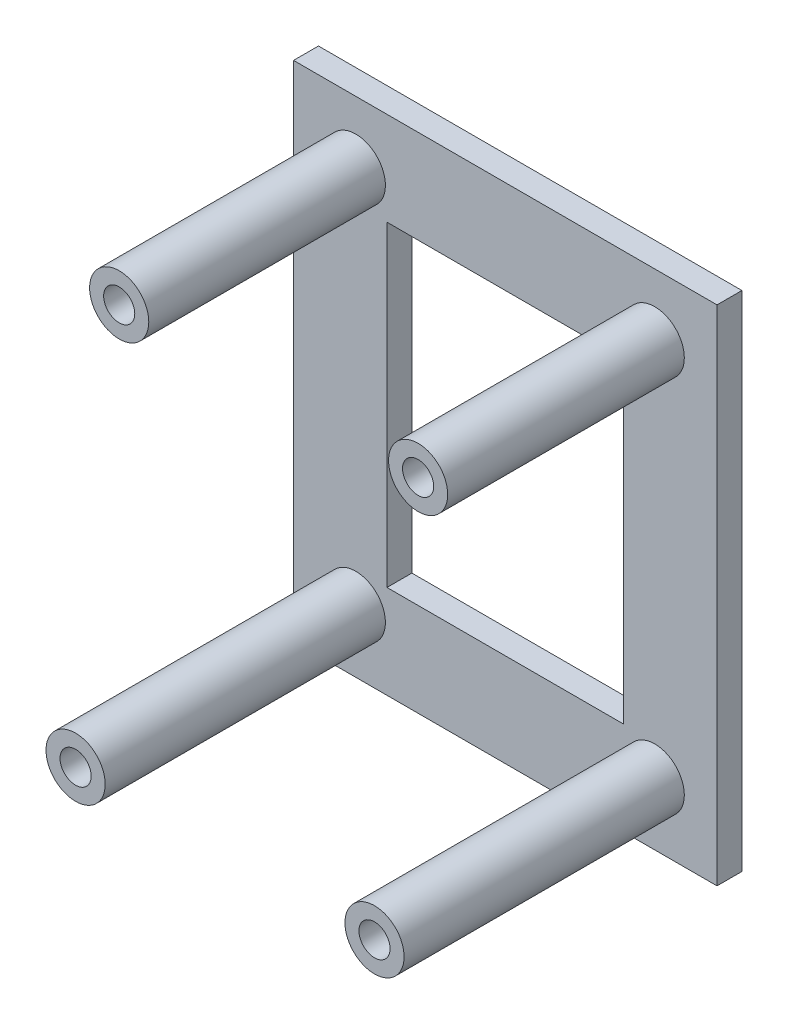
ISO-10303-21;
HEADER;
FILE_DESCRIPTION(('STEP AP214'),'2;1');
FILE_NAME('part.step','',(''),(''),'','','');
FILE_SCHEMA(('AUTOMOTIVE_DESIGN { 1 0 10303 214 1 1 1 1 }'));
ENDSEC;
DATA;
#1=APPLICATION_CONTEXT('core data for automotive mechanical design processes');
#2=APPLICATION_PROTOCOL_DEFINITION('international standard','automotive_design',2000,#1);
#3=PRODUCT_CONTEXT('',#1,'mechanical');
#4=PRODUCT('Part','Part','',(#3));
#5=PRODUCT_RELATED_PRODUCT_CATEGORY('part','',(#4));
#6=PRODUCT_DEFINITION_FORMATION('','',#4);
#7=PRODUCT_DEFINITION_CONTEXT('part definition',#1,'design');
#8=PRODUCT_DEFINITION('design','',#6,#7);
#9=PRODUCT_DEFINITION_SHAPE('','',#8);
#10=(LENGTH_UNIT() NAMED_UNIT(*) SI_UNIT(.MILLI.,.METRE.));
#11=(NAMED_UNIT(*) PLANE_ANGLE_UNIT() SI_UNIT($,.RADIAN.));
#12=(NAMED_UNIT(*) SI_UNIT($,.STERADIAN.) SOLID_ANGLE_UNIT());
#13=UNCERTAINTY_MEASURE_WITH_UNIT(LENGTH_MEASURE(1.E-05),#10,'distance_accuracy_value','');
#14=(GEOMETRIC_REPRESENTATION_CONTEXT(3) GLOBAL_UNCERTAINTY_ASSIGNED_CONTEXT((#13)) GLOBAL_UNIT_ASSIGNED_CONTEXT((#10,
#11,#12)) REPRESENTATION_CONTEXT('',''));
#15=CARTESIAN_POINT('',(0.,0.,0.));
#16=DIRECTION('',(0.,0.,1.));
#17=DIRECTION('',(1.,0.,0.));
#18=AXIS2_PLACEMENT_3D('',#15,#16,#17);
#19=CARTESIAN_POINT('',(-5.,20.2,2.));
#20=DIRECTION('',(1.,0.,0.));
#21=DIRECTION('',(0.,1.,0.));
#22=AXIS2_PLACEMENT_3D('',#19,#20,#21);
#23=PLANE('',#22);
#24=DIRECTION('',(0.,-1.,0.));
#25=VECTOR('',#24,1.);
#26=CARTESIAN_POINT('',(-5.,20.2,0.));
#27=LINE('',#26,#25);
#28=CARTESIAN_POINT('',(-5.,20.2,0.));
#29=VERTEX_POINT('',#28);
#30=CARTESIAN_POINT('',(-5.,-20.2,0.));
#31=VERTEX_POINT('',#30);
#32=EDGE_CURVE('E138',#29,#31,#27,.T.);
#33=ORIENTED_EDGE('',*,*,#32,.T.);
#34=DIRECTION('',(0.,0.,-1.));
#35=VECTOR('',#34,1.);
#36=CARTESIAN_POINT('',(-5.,-20.2,2.));
#37=LINE('',#36,#35);
#38=CARTESIAN_POINT('',(-5.,-20.2,2.));
#39=VERTEX_POINT('',#38);
#40=EDGE_CURVE('E12',#39,#31,#37,.T.);
#41=ORIENTED_EDGE('',*,*,#40,.F.);
#42=DIRECTION('',(0.,-1.,0.));
#43=VECTOR('',#42,1.);
#44=CARTESIAN_POINT('',(-5.,20.2,2.));
#45=LINE('',#44,#43);
#46=CARTESIAN_POINT('',(-5.,20.2,2.));
#47=VERTEX_POINT('',#46);
#48=EDGE_CURVE('E180',#47,#39,#45,.T.);
#49=ORIENTED_EDGE('',*,*,#48,.F.);
#50=DIRECTION('',(0.,0.,-1.));
#51=VECTOR('',#50,1.);
#52=CARTESIAN_POINT('',(-5.,20.2,2.));
#53=LINE('',#52,#51);
#54=EDGE_CURVE('E196',#47,#29,#53,.T.);
#55=ORIENTED_EDGE('',*,*,#54,.T.);
#56=EDGE_LOOP('',(#33,#41,#49,#55));
#57=FACE_BOUND('',#56,.T.);
#58=ADVANCED_FACE('F63',(#57),#23,.F.);
#59=CARTESIAN_POINT('',(-5.,-20.2,2.));
#60=DIRECTION('',(0.,1.,0.));
#61=DIRECTION('',(0.,0.,1.));
#62=AXIS2_PLACEMENT_3D('',#59,#60,#61);
#63=PLANE('',#62);
#64=DIRECTION('',(1.,0.,0.));
#65=VECTOR('',#64,1.);
#66=CARTESIAN_POINT('',(-5.,-20.2,0.));
#67=LINE('',#66,#65);
#68=CARTESIAN_POINT('',(29.,-20.2,0.));
#69=VERTEX_POINT('',#68);
#70=EDGE_CURVE('E200',#31,#69,#67,.T.);
#71=ORIENTED_EDGE('',*,*,#70,.T.);
#72=DIRECTION('',(0.,0.,-1.));
#73=VECTOR('',#72,1.);
#74=CARTESIAN_POINT('',(29.,-20.2,2.));
#75=LINE('',#74,#73);
#76=CARTESIAN_POINT('',(29.,-20.2,2.));
#77=VERTEX_POINT('',#76);
#78=EDGE_CURVE('E71',#77,#69,#75,.T.);
#79=ORIENTED_EDGE('',*,*,#78,.F.);
#80=DIRECTION('',(1.,0.,0.));
#81=VECTOR('',#80,1.);
#82=CARTESIAN_POINT('',(-5.,-20.2,2.));
#83=LINE('',#82,#81);
#84=EDGE_CURVE('E184',#39,#77,#83,.T.);
#85=ORIENTED_EDGE('',*,*,#84,.F.);
#86=ORIENTED_EDGE('',*,*,#40,.T.);
#87=EDGE_LOOP('',(#71,#79,#85,#86));
#88=FACE_BOUND('',#87,.T.);
#89=ADVANCED_FACE('F222',(#88),#63,.F.);
#90=CARTESIAN_POINT('',(29.,20.2,2.));
#91=DIRECTION('',(1.,0.,0.));
#92=DIRECTION('',(0.,1.,0.));
#93=AXIS2_PLACEMENT_3D('',#90,#91,#92);
#94=PLANE('',#93);
#95=DIRECTION('',(0.,-1.,0.));
#96=VECTOR('',#95,1.);
#97=CARTESIAN_POINT('',(29.,20.2,0.));
#98=LINE('',#97,#96);
#99=CARTESIAN_POINT('',(29.,20.2,0.));
#100=VERTEX_POINT('',#99);
#101=EDGE_CURVE('E204',#100,#69,#98,.T.);
#102=ORIENTED_EDGE('',*,*,#101,.F.);
#103=DIRECTION('',(0.,0.,-1.));
#104=VECTOR('',#103,1.);
#105=CARTESIAN_POINT('',(29.,20.2,2.));
#106=LINE('',#105,#104);
#107=CARTESIAN_POINT('',(29.,20.2,2.));
#108=VERTEX_POINT('',#107);
#109=EDGE_CURVE('E213',#108,#100,#106,.T.);
#110=ORIENTED_EDGE('',*,*,#109,.F.);
#111=DIRECTION('',(0.,-1.,0.));
#112=VECTOR('',#111,1.);
#113=CARTESIAN_POINT('',(29.,20.2,2.));
#114=LINE('',#113,#112);
#115=EDGE_CURVE('E188',#108,#77,#114,.T.);
#116=ORIENTED_EDGE('',*,*,#115,.T.);
#117=ORIENTED_EDGE('',*,*,#78,.T.);
#118=EDGE_LOOP('',(#102,#110,#116,#117));
#119=FACE_BOUND('',#118,.T.);
#120=ADVANCED_FACE('F219',(#119),#94,.T.);
#121=CARTESIAN_POINT('',(-5.,20.2,2.));
#122=DIRECTION('',(0.,1.,0.));
#123=DIRECTION('',(0.,0.,1.));
#124=AXIS2_PLACEMENT_3D('',#121,#122,#123);
#125=PLANE('',#124);
#126=DIRECTION('',(1.,0.,0.));
#127=VECTOR('',#126,1.);
#128=CARTESIAN_POINT('',(-5.,20.2,0.));
#129=LINE('',#128,#127);
#130=EDGE_CURVE('E185',#29,#100,#129,.T.);
#131=ORIENTED_EDGE('',*,*,#130,.F.);
#132=ORIENTED_EDGE('',*,*,#54,.F.);
#133=DIRECTION('',(1.,0.,0.));
#134=VECTOR('',#133,1.);
#135=CARTESIAN_POINT('',(-5.,20.2,2.));
#136=LINE('',#135,#134);
#137=EDGE_CURVE('E192',#47,#108,#136,.T.);
#138=ORIENTED_EDGE('',*,*,#137,.T.);
#139=ORIENTED_EDGE('',*,*,#109,.T.);
#140=EDGE_LOOP('',(#131,#132,#138,#139));
#141=FACE_BOUND('',#140,.T.);
#142=ADVANCED_FACE('F229',(#141),#125,.T.);
#143=CARTESIAN_POINT('',(0.,0.,2.));
#144=DIRECTION('',(0.,0.,1.));
#145=DIRECTION('',(1.,0.,0.));
#146=AXIS2_PLACEMENT_3D('',#143,#144,#145);
#147=PLANE('',#146);
#148=CARTESIAN_POINT('',(0.,-15.2,2.));
#149=DIRECTION('',(0.,0.,1.));
#150=DIRECTION('',(1.,0.,0.));
#151=AXIS2_PLACEMENT_3D('',#148,#149,#150);
#152=CIRCLE('',#151,2.375);
#153=CARTESIAN_POINT('',(2.375,-15.2,2.));
#154=VERTEX_POINT('',#153);
#155=EDGE_CURVE('E336',#154,#154,#152,.F.);
#156=ORIENTED_EDGE('',*,*,#155,.T.);
#157=EDGE_LOOP('',(#156));
#158=FACE_BOUND('',#157,.T.);
#159=CARTESIAN_POINT('',(24.,-15.2,2.));
#160=DIRECTION('',(0.,0.,1.));
#161=DIRECTION('',(1.,0.,0.));
#162=AXIS2_PLACEMENT_3D('',#159,#160,#161);
#163=CIRCLE('',#162,2.375);
#164=CARTESIAN_POINT('',(26.375,-15.2,2.));
#165=VERTEX_POINT('',#164);
#166=EDGE_CURVE('E356',#165,#165,#163,.F.);
#167=ORIENTED_EDGE('',*,*,#166,.T.);
#168=EDGE_LOOP('',(#167));
#169=FACE_BOUND('',#168,.T.);
#170=CARTESIAN_POINT('',(0.,15.2,2.));
#171=DIRECTION('',(0.,0.,1.));
#172=DIRECTION('',(1.,0.,0.));
#173=AXIS2_PLACEMENT_3D('',#170,#171,#172);
#174=CIRCLE('',#173,2.375);
#175=CARTESIAN_POINT('',(2.375,15.2,2.));
#176=VERTEX_POINT('',#175);
#177=EDGE_CURVE('E380',#176,#176,#174,.F.);
#178=ORIENTED_EDGE('',*,*,#177,.T.);
#179=EDGE_LOOP('',(#178));
#180=FACE_BOUND('',#179,.T.);
#181=CARTESIAN_POINT('',(24.,15.2,2.));
#182=DIRECTION('',(0.,0.,1.));
#183=DIRECTION('',(1.,0.,0.));
#184=AXIS2_PLACEMENT_3D('',#181,#182,#183);
#185=CIRCLE('',#184,2.375);
#186=CARTESIAN_POINT('',(26.375,15.2,2.));
#187=VERTEX_POINT('',#186);
#188=EDGE_CURVE('E164',#187,#187,#185,.F.);
#189=ORIENTED_EDGE('',*,*,#188,.T.);
#190=EDGE_LOOP('',(#189));
#191=FACE_BOUND('',#190,.T.);
#192=DIRECTION('',(0.,-1.,0.));
#193=VECTOR('',#192,1.);
#194=CARTESIAN_POINT('',(21.5,0.,2.));
#195=LINE('',#194,#193);
#196=CARTESIAN_POINT('',(21.5,12.7,2.));
#197=VERTEX_POINT('',#196);
#198=CARTESIAN_POINT('',(21.5,-12.7,2.));
#199=VERTEX_POINT('',#198);
#200=EDGE_CURVE('E142',#197,#199,#195,.T.);
#201=ORIENTED_EDGE('',*,*,#200,.T.);
#202=DIRECTION('',(1.,0.,0.));
#203=VECTOR('',#202,1.);
#204=CARTESIAN_POINT('',(0.,-12.7,2.));
#205=LINE('',#204,#203);
#206=CARTESIAN_POINT('',(2.5,-12.7,2.));
#207=VERTEX_POINT('',#206);
#208=EDGE_CURVE('E156',#207,#199,#205,.T.);
#209=ORIENTED_EDGE('',*,*,#208,.F.);
#210=DIRECTION('',(0.,-1.,0.));
#211=VECTOR('',#210,1.);
#212=CARTESIAN_POINT('',(2.5,0.,2.));
#213=LINE('',#212,#211);
#214=CARTESIAN_POINT('',(2.5,12.7,2.));
#215=VERTEX_POINT('',#214);
#216=EDGE_CURVE('E152',#215,#207,#213,.T.);
#217=ORIENTED_EDGE('',*,*,#216,.F.);
#218=DIRECTION('',(1.,0.,0.));
#219=VECTOR('',#218,1.);
#220=CARTESIAN_POINT('',(0.,12.7,2.));
#221=LINE('',#220,#219);
#222=EDGE_CURVE('E133',#215,#197,#221,.T.);
#223=ORIENTED_EDGE('',*,*,#222,.T.);
#224=EDGE_LOOP('',(#201,#209,#217,#223));
#225=FACE_BOUND('',#224,.T.);
#226=ORIENTED_EDGE('',*,*,#48,.T.);
#227=ORIENTED_EDGE('',*,*,#84,.T.);
#228=ORIENTED_EDGE('',*,*,#115,.F.);
#229=ORIENTED_EDGE('',*,*,#137,.F.);
#230=EDGE_LOOP('',(#226,#227,#228,#229));
#231=FACE_BOUND('',#230,.T.);
#232=ADVANCED_FACE('F150',(#158,#169,#180,#191,#225,#231),#147,.T.);
#233=CARTESIAN_POINT('',(0.,0.,0.));
#234=DIRECTION('',(0.,0.,1.));
#235=DIRECTION('',(1.,0.,0.));
#236=AXIS2_PLACEMENT_3D('',#233,#234,#235);
#237=PLANE('',#236);
#238=DIRECTION('',(1.,0.,0.));
#239=VECTOR('',#238,1.);
#240=CARTESIAN_POINT('',(0.,-12.7,0.));
#241=LINE('',#240,#239);
#242=CARTESIAN_POINT('',(2.5,-12.7,0.));
#243=VERTEX_POINT('',#242);
#244=CARTESIAN_POINT('',(21.5,-12.7,0.));
#245=VERTEX_POINT('',#244);
#246=EDGE_CURVE('E148',#243,#245,#241,.T.);
#247=ORIENTED_EDGE('',*,*,#246,.T.);
#248=DIRECTION('',(0.,-1.,0.));
#249=VECTOR('',#248,1.);
#250=CARTESIAN_POINT('',(21.5,0.,0.));
#251=LINE('',#250,#249);
#252=CARTESIAN_POINT('',(21.5,12.7,0.));
#253=VERTEX_POINT('',#252);
#254=EDGE_CURVE('E86',#253,#245,#251,.T.);
#255=ORIENTED_EDGE('',*,*,#254,.F.);
#256=DIRECTION('',(1.,0.,0.));
#257=VECTOR('',#256,1.);
#258=CARTESIAN_POINT('',(0.,12.7,0.));
#259=LINE('',#258,#257);
#260=CARTESIAN_POINT('',(2.5,12.7,0.));
#261=VERTEX_POINT('',#260);
#262=EDGE_CURVE('E136',#261,#253,#259,.T.);
#263=ORIENTED_EDGE('',*,*,#262,.F.);
#264=DIRECTION('',(0.,-1.,0.));
#265=VECTOR('',#264,1.);
#266=CARTESIAN_POINT('',(2.5,0.,0.));
#267=LINE('',#266,#265);
#268=EDGE_CURVE('E167',#261,#243,#267,.T.);
#269=ORIENTED_EDGE('',*,*,#268,.T.);
#270=EDGE_LOOP('',(#247,#255,#263,#269));
#271=FACE_BOUND('',#270,.T.);
#272=ORIENTED_EDGE('',*,*,#32,.F.);
#273=ORIENTED_EDGE('',*,*,#130,.T.);
#274=ORIENTED_EDGE('',*,*,#101,.T.);
#275=ORIENTED_EDGE('',*,*,#70,.F.);
#276=EDGE_LOOP('',(#272,#273,#274,#275));
#277=FACE_BOUND('',#276,.T.);
#278=ADVANCED_FACE('F226',(#271,#277),#237,.F.);
#279=CARTESIAN_POINT('',(21.5,0.,2.));
#280=DIRECTION('',(1.,0.,0.));
#281=DIRECTION('',(0.,1.,0.));
#282=AXIS2_PLACEMENT_3D('',#279,#280,#281);
#283=PLANE('',#282);
#284=ORIENTED_EDGE('',*,*,#254,.T.);
#285=DIRECTION('',(0.,0.,-1.));
#286=VECTOR('',#285,1.);
#287=CARTESIAN_POINT('',(21.5,-12.7,2.));
#288=LINE('',#287,#286);
#289=EDGE_CURVE('E144',#199,#245,#288,.T.);
#290=ORIENTED_EDGE('',*,*,#289,.F.);
#291=ORIENTED_EDGE('',*,*,#200,.F.);
#292=DIRECTION('',(0.,0.,-1.));
#293=VECTOR('',#292,1.);
#294=CARTESIAN_POINT('',(21.5,12.7,2.));
#295=LINE('',#294,#293);
#296=EDGE_CURVE('E129',#197,#253,#295,.T.);
#297=ORIENTED_EDGE('',*,*,#296,.T.);
#298=EDGE_LOOP('',(#284,#290,#291,#297));
#299=FACE_BOUND('',#298,.T.);
#300=ADVANCED_FACE('F143',(#299),#283,.F.);
#301=CARTESIAN_POINT('',(0.,12.7,2.));
#302=DIRECTION('',(0.,1.,0.));
#303=DIRECTION('',(0.,0.,1.));
#304=AXIS2_PLACEMENT_3D('',#301,#302,#303);
#305=PLANE('',#304);
#306=ORIENTED_EDGE('',*,*,#262,.T.);
#307=ORIENTED_EDGE('',*,*,#296,.F.);
#308=ORIENTED_EDGE('',*,*,#222,.F.);
#309=DIRECTION('',(0.,0.,-1.));
#310=VECTOR('',#309,1.);
#311=CARTESIAN_POINT('',(2.5,12.7,2.));
#312=LINE('',#311,#310);
#313=EDGE_CURVE('E139',#215,#261,#312,.T.);
#314=ORIENTED_EDGE('',*,*,#313,.T.);
#315=EDGE_LOOP('',(#306,#307,#308,#314));
#316=FACE_BOUND('',#315,.T.);
#317=ADVANCED_FACE('F131',(#316),#305,.F.);
#318=CARTESIAN_POINT('',(2.5,0.,2.));
#319=DIRECTION('',(1.,0.,0.));
#320=DIRECTION('',(0.,1.,0.));
#321=AXIS2_PLACEMENT_3D('',#318,#319,#320);
#322=PLANE('',#321);
#323=ORIENTED_EDGE('',*,*,#268,.F.);
#324=ORIENTED_EDGE('',*,*,#313,.F.);
#325=ORIENTED_EDGE('',*,*,#216,.T.);
#326=DIRECTION('',(0.,0.,-1.));
#327=VECTOR('',#326,1.);
#328=CARTESIAN_POINT('',(2.5,-12.7,2.));
#329=LINE('',#328,#327);
#330=EDGE_CURVE('E78',#207,#243,#329,.T.);
#331=ORIENTED_EDGE('',*,*,#330,.T.);
#332=EDGE_LOOP('',(#323,#324,#325,#331));
#333=FACE_BOUND('',#332,.T.);
#334=ADVANCED_FACE('F254',(#333),#322,.T.);
#335=CARTESIAN_POINT('',(0.,-12.7,2.));
#336=DIRECTION('',(0.,1.,0.));
#337=DIRECTION('',(0.,0.,1.));
#338=AXIS2_PLACEMENT_3D('',#335,#336,#337);
#339=PLANE('',#338);
#340=ORIENTED_EDGE('',*,*,#246,.F.);
#341=ORIENTED_EDGE('',*,*,#330,.F.);
#342=ORIENTED_EDGE('',*,*,#208,.T.);
#343=ORIENTED_EDGE('',*,*,#289,.T.);
#344=EDGE_LOOP('',(#340,#341,#342,#343));
#345=FACE_BOUND('',#344,.T.);
#346=ADVANCED_FACE('F257',(#345),#339,.T.);
#347=CARTESIAN_POINT('',(24.,15.2,21.));
#348=DIRECTION('',(0.,0.,-1.));
#349=DIRECTION('',(-1.,0.,0.));
#350=AXIS2_PLACEMENT_3D('',#347,#348,#349);
#351=CYLINDRICAL_SURFACE('',#350,2.375);
#352=ORIENTED_EDGE('',*,*,#188,.F.);
#353=EDGE_LOOP('',(#352));
#354=FACE_BOUND('',#353,.T.);
#355=CARTESIAN_POINT('',(24.,15.2,21.));
#356=DIRECTION('',(0.,0.,1.));
#357=DIRECTION('',(1.,0.,0.));
#358=AXIS2_PLACEMENT_3D('',#355,#356,#357);
#359=CIRCLE('',#358,2.375);
#360=CARTESIAN_POINT('',(26.375,15.2,21.));
#361=VERTEX_POINT('',#360);
#362=EDGE_CURVE('E384',#361,#361,#359,.T.);
#363=ORIENTED_EDGE('',*,*,#362,.F.);
#364=EDGE_LOOP('',(#363));
#365=FACE_BOUND('',#364,.T.);
#366=ADVANCED_FACE('F261',(#354,#365),#351,.T.);
#367=CARTESIAN_POINT('',(24.,15.2,21.));
#368=DIRECTION('',(0.,0.,1.));
#369=DIRECTION('',(1.,0.,0.));
#370=AXIS2_PLACEMENT_3D('',#367,#368,#369);
#371=PLANE('',#370);
#372=CARTESIAN_POINT('',(24.,15.2,21.));
#373=DIRECTION('',(0.,0.,1.));
#374=DIRECTION('',(1.,0.,0.));
#375=AXIS2_PLACEMENT_3D('',#372,#373,#374);
#376=CIRCLE('',#375,1.25);
#377=CARTESIAN_POINT('',(25.25,15.2,21.));
#378=VERTEX_POINT('',#377);
#379=EDGE_CURVE('E360',#378,#378,#376,.T.);
#380=ORIENTED_EDGE('',*,*,#379,.F.);
#381=EDGE_LOOP('',(#380));
#382=FACE_BOUND('',#381,.T.);
#383=ORIENTED_EDGE('',*,*,#362,.T.);
#384=EDGE_LOOP('',(#383));
#385=FACE_BOUND('',#384,.T.);
#386=ADVANCED_FACE('F264',(#382,#385),#371,.T.);
#387=CARTESIAN_POINT('',(0.,15.2,21.));
#388=DIRECTION('',(0.,0.,-1.));
#389=DIRECTION('',(-1.,0.,0.));
#390=AXIS2_PLACEMENT_3D('',#387,#388,#389);
#391=CYLINDRICAL_SURFACE('',#390,2.375);
#392=ORIENTED_EDGE('',*,*,#177,.F.);
#393=EDGE_LOOP('',(#392));
#394=FACE_BOUND('',#393,.T.);
#395=CARTESIAN_POINT('',(0.,15.2,21.));
#396=DIRECTION('',(0.,0.,1.));
#397=DIRECTION('',(1.,0.,0.));
#398=AXIS2_PLACEMENT_3D('',#395,#396,#397);
#399=CIRCLE('',#398,2.375);
#400=CARTESIAN_POINT('',(2.375,15.2,21.));
#401=VERTEX_POINT('',#400);
#402=EDGE_CURVE('E365',#401,#401,#399,.T.);
#403=ORIENTED_EDGE('',*,*,#402,.F.);
#404=EDGE_LOOP('',(#403));
#405=FACE_BOUND('',#404,.T.);
#406=ADVANCED_FACE('F268',(#394,#405),#391,.T.);
#407=CARTESIAN_POINT('',(0.,15.2,21.));
#408=DIRECTION('',(0.,0.,1.));
#409=DIRECTION('',(1.,0.,0.));
#410=AXIS2_PLACEMENT_3D('',#407,#408,#409);
#411=PLANE('',#410);
#412=CARTESIAN_POINT('',(0.,15.2,21.));
#413=DIRECTION('',(0.,0.,1.));
#414=DIRECTION('',(1.,0.,0.));
#415=AXIS2_PLACEMENT_3D('',#412,#413,#414);
#416=CIRCLE('',#415,1.25);
#417=CARTESIAN_POINT('',(1.25,15.2,21.));
#418=VERTEX_POINT('',#417);
#419=EDGE_CURVE('E366',#418,#418,#416,.T.);
#420=ORIENTED_EDGE('',*,*,#419,.F.);
#421=EDGE_LOOP('',(#420));
#422=FACE_BOUND('',#421,.T.);
#423=ORIENTED_EDGE('',*,*,#402,.T.);
#424=EDGE_LOOP('',(#423));
#425=FACE_BOUND('',#424,.T.);
#426=ADVANCED_FACE('F270',(#422,#425),#411,.T.);
#427=CARTESIAN_POINT('',(0.,15.2,6.));
#428=DIRECTION('',(0.,0.,1.));
#429=DIRECTION('',(1.,0.,0.));
#430=AXIS2_PLACEMENT_3D('',#427,#428,#429);
#431=CYLINDRICAL_SURFACE('',#430,1.25);
#432=CARTESIAN_POINT('',(0.,15.2,6.));
#433=DIRECTION('',(0.,0.,1.));
#434=DIRECTION('',(1.,0.,0.));
#435=AXIS2_PLACEMENT_3D('',#432,#433,#434);
#436=CIRCLE('',#435,1.25);
#437=CARTESIAN_POINT('',(1.25,15.2,6.));
#438=VERTEX_POINT('',#437);
#439=EDGE_CURVE('E361',#438,#438,#436,.T.);
#440=ORIENTED_EDGE('',*,*,#439,.F.);
#441=EDGE_LOOP('',(#440));
#442=FACE_BOUND('',#441,.T.);
#443=ORIENTED_EDGE('',*,*,#419,.T.);
#444=EDGE_LOOP('',(#443));
#445=FACE_BOUND('',#444,.T.);
#446=ADVANCED_FACE('F273',(#442,#445),#431,.F.);
#447=CARTESIAN_POINT('',(0.,15.2,6.));
#448=DIRECTION('',(0.,0.,1.));
#449=DIRECTION('',(1.,0.,0.));
#450=AXIS2_PLACEMENT_3D('',#447,#448,#449);
#451=PLANE('',#450);
#452=ORIENTED_EDGE('',*,*,#439,.T.);
#453=EDGE_LOOP('',(#452));
#454=FACE_BOUND('',#453,.T.);
#455=ADVANCED_FACE('F282',(#454),#451,.T.);
#456=CARTESIAN_POINT('',(24.,15.2,6.));
#457=DIRECTION('',(0.,0.,1.));
#458=DIRECTION('',(1.,0.,0.));
#459=AXIS2_PLACEMENT_3D('',#456,#457,#458);
#460=CYLINDRICAL_SURFACE('',#459,1.25);
#461=CARTESIAN_POINT('',(24.,15.2,6.));
#462=DIRECTION('',(0.,0.,1.));
#463=DIRECTION('',(1.,0.,0.));
#464=AXIS2_PLACEMENT_3D('',#461,#462,#463);
#465=CIRCLE('',#464,1.25);
#466=CARTESIAN_POINT('',(25.25,15.2,6.));
#467=VERTEX_POINT('',#466);
#468=EDGE_CURVE('E370',#467,#467,#465,.T.);
#469=ORIENTED_EDGE('',*,*,#468,.F.);
#470=EDGE_LOOP('',(#469));
#471=FACE_BOUND('',#470,.T.);
#472=ORIENTED_EDGE('',*,*,#379,.T.);
#473=EDGE_LOOP('',(#472));
#474=FACE_BOUND('',#473,.T.);
#475=ADVANCED_FACE('F278',(#471,#474),#460,.F.);
#476=CARTESIAN_POINT('',(24.,15.2,6.));
#477=DIRECTION('',(0.,0.,1.));
#478=DIRECTION('',(1.,0.,0.));
#479=AXIS2_PLACEMENT_3D('',#476,#477,#478);
#480=PLANE('',#479);
#481=ORIENTED_EDGE('',*,*,#468,.T.);
#482=EDGE_LOOP('',(#481));
#483=FACE_BOUND('',#482,.T.);
#484=ADVANCED_FACE('F281',(#483),#480,.T.);
#485=CARTESIAN_POINT('',(24.,-15.2,24.5));
#486=DIRECTION('',(0.,0.,-1.));
#487=DIRECTION('',(-1.,0.,0.));
#488=AXIS2_PLACEMENT_3D('',#485,#486,#487);
#489=CYLINDRICAL_SURFACE('',#488,2.375);
#490=ORIENTED_EDGE('',*,*,#166,.F.);
#491=EDGE_LOOP('',(#490));
#492=FACE_BOUND('',#491,.T.);
#493=CARTESIAN_POINT('',(24.,-15.2,24.5));
#494=DIRECTION('',(0.,0.,1.));
#495=DIRECTION('',(1.,0.,0.));
#496=AXIS2_PLACEMENT_3D('',#493,#494,#495);
#497=CIRCLE('',#496,2.375);
#498=CARTESIAN_POINT('',(26.375,-15.2,24.5));
#499=VERTEX_POINT('',#498);
#500=EDGE_CURVE('E352',#499,#499,#497,.T.);
#501=ORIENTED_EDGE('',*,*,#500,.F.);
#502=EDGE_LOOP('',(#501));
#503=FACE_BOUND('',#502,.T.);
#504=ADVANCED_FACE('F286',(#492,#503),#489,.T.);
#505=CARTESIAN_POINT('',(24.,-15.2,24.5));
#506=DIRECTION('',(0.,0.,1.));
#507=DIRECTION('',(1.,0.,0.));
#508=AXIS2_PLACEMENT_3D('',#505,#506,#507);
#509=PLANE('',#508);
#510=CARTESIAN_POINT('',(24.,-15.2,24.5));
#511=DIRECTION('',(0.,0.,1.));
#512=DIRECTION('',(1.,0.,0.));
#513=AXIS2_PLACEMENT_3D('',#510,#511,#512);
#514=CIRCLE('',#513,1.25);
#515=CARTESIAN_POINT('',(25.25,-15.2,24.5));
#516=VERTEX_POINT('',#515);
#517=EDGE_CURVE('E339',#516,#516,#514,.T.);
#518=ORIENTED_EDGE('',*,*,#517,.F.);
#519=EDGE_LOOP('',(#518));
#520=FACE_BOUND('',#519,.T.);
#521=ORIENTED_EDGE('',*,*,#500,.T.);
#522=EDGE_LOOP('',(#521));
#523=FACE_BOUND('',#522,.T.);
#524=ADVANCED_FACE('F296',(#520,#523),#509,.T.);
#525=CARTESIAN_POINT('',(0.,-15.2,24.5));
#526=DIRECTION('',(0.,0.,-1.));
#527=DIRECTION('',(-1.,0.,0.));
#528=AXIS2_PLACEMENT_3D('',#525,#526,#527);
#529=CYLINDRICAL_SURFACE('',#528,2.375);
#530=ORIENTED_EDGE('',*,*,#155,.F.);
#531=EDGE_LOOP('',(#530));
#532=FACE_BOUND('',#531,.T.);
#533=CARTESIAN_POINT('',(0.,-15.2,24.5));
#534=DIRECTION('',(0.,0.,1.));
#535=DIRECTION('',(1.,0.,0.));
#536=AXIS2_PLACEMENT_3D('',#533,#534,#535);
#537=CIRCLE('',#536,2.375);
#538=CARTESIAN_POINT('',(2.375,-15.2,24.5));
#539=VERTEX_POINT('',#538);
#540=EDGE_CURVE('E330',#539,#539,#537,.T.);
#541=ORIENTED_EDGE('',*,*,#540,.F.);
#542=EDGE_LOOP('',(#541));
#543=FACE_BOUND('',#542,.T.);
#544=ADVANCED_FACE('F300',(#532,#543),#529,.T.);
#545=CARTESIAN_POINT('',(0.,-15.2,24.5));
#546=DIRECTION('',(0.,0.,1.));
#547=DIRECTION('',(1.,0.,0.));
#548=AXIS2_PLACEMENT_3D('',#545,#546,#547);
#549=PLANE('',#548);
#550=CARTESIAN_POINT('',(0.,-15.2,24.5));
#551=DIRECTION('',(0.,0.,1.));
#552=DIRECTION('',(1.,0.,0.));
#553=AXIS2_PLACEMENT_3D('',#550,#551,#552);
#554=CIRCLE('',#553,1.25);
#555=CARTESIAN_POINT('',(1.25,-15.2,24.5));
#556=VERTEX_POINT('',#555);
#557=EDGE_CURVE('E331',#556,#556,#554,.T.);
#558=ORIENTED_EDGE('',*,*,#557,.F.);
#559=EDGE_LOOP('',(#558));
#560=FACE_BOUND('',#559,.T.);
#561=ORIENTED_EDGE('',*,*,#540,.T.);
#562=EDGE_LOOP('',(#561));
#563=FACE_BOUND('',#562,.T.);
#564=ADVANCED_FACE('F302',(#560,#563),#549,.T.);
#565=CARTESIAN_POINT('',(0.,-15.2,6.));
#566=DIRECTION('',(0.,0.,1.));
#567=DIRECTION('',(1.,0.,0.));
#568=AXIS2_PLACEMENT_3D('',#565,#566,#567);
#569=CYLINDRICAL_SURFACE('',#568,1.25);
#570=CARTESIAN_POINT('',(0.,-15.2,6.));
#571=DIRECTION('',(0.,0.,1.));
#572=DIRECTION('',(1.,0.,0.));
#573=AXIS2_PLACEMENT_3D('',#570,#571,#572);
#574=CIRCLE('',#573,1.25);
#575=CARTESIAN_POINT('',(1.25,-15.2,6.));
#576=VERTEX_POINT('',#575);
#577=EDGE_CURVE('E328',#576,#576,#574,.T.);
#578=ORIENTED_EDGE('',*,*,#577,.F.);
#579=EDGE_LOOP('',(#578));
#580=FACE_BOUND('',#579,.T.);
#581=ORIENTED_EDGE('',*,*,#557,.T.);
#582=EDGE_LOOP('',(#581));
#583=FACE_BOUND('',#582,.T.);
#584=ADVANCED_FACE('F305',(#580,#583),#569,.F.);
#585=CARTESIAN_POINT('',(0.,-15.2,6.));
#586=DIRECTION('',(0.,0.,1.));
#587=DIRECTION('',(1.,0.,0.));
#588=AXIS2_PLACEMENT_3D('',#585,#586,#587);
#589=PLANE('',#588);
#590=ORIENTED_EDGE('',*,*,#577,.T.);
#591=EDGE_LOOP('',(#590));
#592=FACE_BOUND('',#591,.T.);
#593=ADVANCED_FACE('F317',(#592),#589,.T.);
#594=CARTESIAN_POINT('',(24.,-15.2,6.));
#595=DIRECTION('',(0.,0.,1.));
#596=DIRECTION('',(1.,0.,0.));
#597=AXIS2_PLACEMENT_3D('',#594,#595,#596);
#598=CYLINDRICAL_SURFACE('',#597,1.25);
#599=CARTESIAN_POINT('',(24.,-15.2,6.));
#600=DIRECTION('',(0.,0.,1.));
#601=DIRECTION('',(1.,0.,0.));
#602=AXIS2_PLACEMENT_3D('',#599,#600,#601);
#603=CIRCLE('',#602,1.25);
#604=CARTESIAN_POINT('',(25.25,-15.2,6.));
#605=VERTEX_POINT('',#604);
#606=EDGE_CURVE('E345',#605,#605,#603,.T.);
#607=ORIENTED_EDGE('',*,*,#606,.F.);
#608=EDGE_LOOP('',(#607));
#609=FACE_BOUND('',#608,.T.);
#610=ORIENTED_EDGE('',*,*,#517,.T.);
#611=EDGE_LOOP('',(#610));
#612=FACE_BOUND('',#611,.T.);
#613=ADVANCED_FACE('F313',(#609,#612),#598,.F.);
#614=CARTESIAN_POINT('',(24.,-15.2,6.));
#615=DIRECTION('',(0.,0.,1.));
#616=DIRECTION('',(1.,0.,0.));
#617=AXIS2_PLACEMENT_3D('',#614,#615,#616);
#618=PLANE('',#617);
#619=ORIENTED_EDGE('',*,*,#606,.T.);
#620=EDGE_LOOP('',(#619));
#621=FACE_BOUND('',#620,.T.);
#622=ADVANCED_FACE('F310',(#621),#618,.T.);
#623=CLOSED_SHELL('',(#58,#89,#120,#142,#232,#278,#300,#317,#334,#346,#366,#386,#406,#426,#446,
#455,#475,#484,#504,#524,#544,#564,#584,#593,#613,#622));
#624=MANIFOLD_SOLID_BREP('B2',#623);
#625=ADVANCED_BREP_SHAPE_REPRESENTATION('',(#18,#624),#14);
#626=SHAPE_DEFINITION_REPRESENTATION(#9,#625);
ENDSEC;
END-ISO-10303-21;
